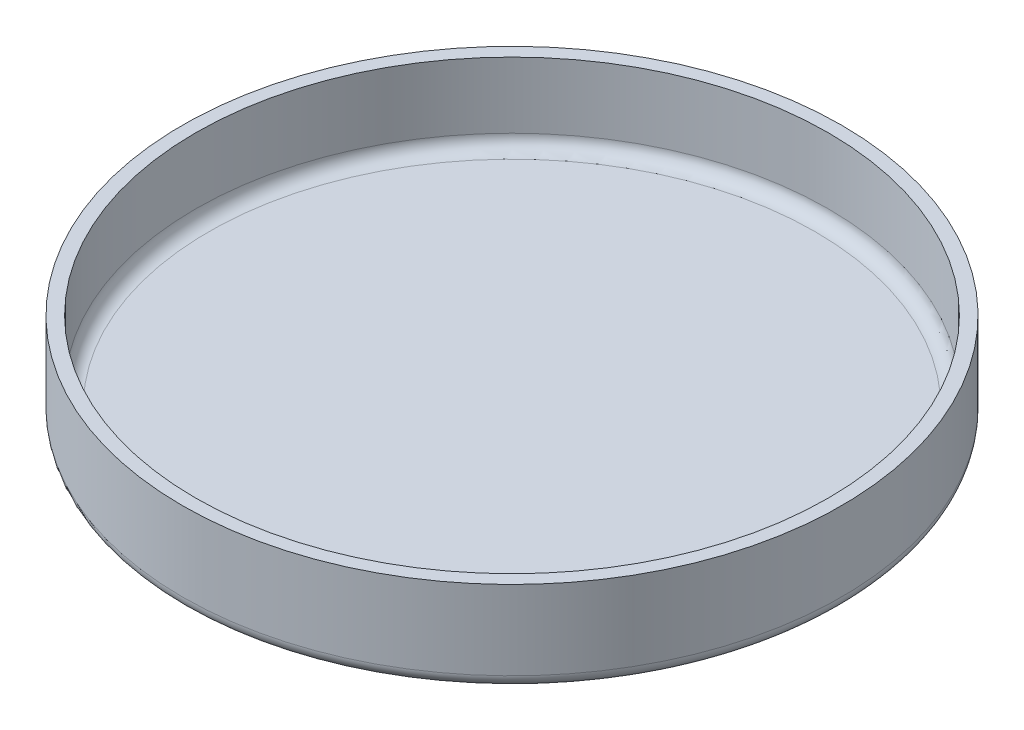
ISO-10303-21;
HEADER;
FILE_DESCRIPTION(('STEP AP214'),'2;1');
FILE_NAME('part.step','',(''),(''),'','','');
FILE_SCHEMA(('AUTOMOTIVE_DESIGN { 1 0 10303 214 1 1 1 1 }'));
ENDSEC;
DATA;
#1=APPLICATION_CONTEXT('core data for automotive mechanical design processes');
#2=APPLICATION_PROTOCOL_DEFINITION('international standard','automotive_design',2000,#1);
#3=PRODUCT_CONTEXT('',#1,'mechanical');
#4=PRODUCT('Part','Part','',(#3));
#5=PRODUCT_RELATED_PRODUCT_CATEGORY('part','',(#4));
#6=PRODUCT_DEFINITION_FORMATION('','',#4);
#7=PRODUCT_DEFINITION_CONTEXT('part definition',#1,'design');
#8=PRODUCT_DEFINITION('design','',#6,#7);
#9=PRODUCT_DEFINITION_SHAPE('','',#8);
#10=(LENGTH_UNIT() NAMED_UNIT(*) SI_UNIT(.MILLI.,.METRE.));
#11=(NAMED_UNIT(*) PLANE_ANGLE_UNIT() SI_UNIT($,.RADIAN.));
#12=(NAMED_UNIT(*) SI_UNIT($,.STERADIAN.) SOLID_ANGLE_UNIT());
#13=UNCERTAINTY_MEASURE_WITH_UNIT(LENGTH_MEASURE(1.E-05),#10,'distance_accuracy_value','');
#14=(GEOMETRIC_REPRESENTATION_CONTEXT(3) GLOBAL_UNCERTAINTY_ASSIGNED_CONTEXT((#13)) GLOBAL_UNIT_ASSIGNED_CONTEXT((#10,
#11,#12)) REPRESENTATION_CONTEXT('',''));
#15=CARTESIAN_POINT('',(0.,0.,0.));
#16=DIRECTION('',(0.,0.,1.));
#17=DIRECTION('',(1.,0.,0.));
#18=AXIS2_PLACEMENT_3D('',#15,#16,#17);
#19=CARTESIAN_POINT('',(0.,7.,0.));
#20=DIRECTION('',(0.,-1.,0.));
#21=DIRECTION('',(0.,0.,-1.));
#22=AXIS2_PLACEMENT_3D('',#19,#20,#21);
#23=CYLINDRICAL_SURFACE('',#22,25.);
#24=CARTESIAN_POINT('',(0.,1.,0.));
#25=DIRECTION('',(0.,1.,0.));
#26=DIRECTION('',(0.,0.,1.));
#27=AXIS2_PLACEMENT_3D('',#24,#25,#26);
#28=CIRCLE('',#27,25.);
#29=CARTESIAN_POINT('',(0.,1.,25.));
#30=VERTEX_POINT('',#29);
#31=EDGE_CURVE('E47',#30,#30,#28,.T.);
#32=ORIENTED_EDGE('',*,*,#31,.T.);
#33=EDGE_LOOP('',(#32));
#34=FACE_BOUND('',#33,.T.);
#35=CARTESIAN_POINT('',(0.,7.,0.));
#36=DIRECTION('',(0.,1.,0.));
#37=DIRECTION('',(0.,0.,1.));
#38=AXIS2_PLACEMENT_3D('',#35,#36,#37);
#39=CIRCLE('',#38,25.);
#40=CARTESIAN_POINT('',(0.,7.,25.));
#41=VERTEX_POINT('',#40);
#42=EDGE_CURVE('E52',#41,#41,#39,.T.);
#43=ORIENTED_EDGE('',*,*,#42,.F.);
#44=EDGE_LOOP('',(#43));
#45=FACE_BOUND('',#44,.T.);
#46=ADVANCED_FACE('F32',(#34,#45),#23,.T.);
#47=CARTESIAN_POINT('',(0.,7.,0.));
#48=DIRECTION('',(0.,1.,0.));
#49=DIRECTION('',(0.,0.,1.));
#50=AXIS2_PLACEMENT_3D('',#47,#48,#49);
#51=PLANE('',#50);
#52=CARTESIAN_POINT('',(0.,7.,0.));
#53=DIRECTION('',(0.,1.,0.));
#54=DIRECTION('',(0.,0.,1.));
#55=AXIS2_PLACEMENT_3D('',#52,#53,#54);
#56=CIRCLE('',#55,24.);
#57=CARTESIAN_POINT('',(0.,7.,24.));
#58=VERTEX_POINT('',#57);
#59=EDGE_CURVE('E55',#58,#58,#56,.T.);
#60=ORIENTED_EDGE('',*,*,#59,.F.);
#61=EDGE_LOOP('',(#60));
#62=FACE_BOUND('',#61,.T.);
#63=ORIENTED_EDGE('',*,*,#42,.T.);
#64=EDGE_LOOP('',(#63));
#65=FACE_BOUND('',#64,.T.);
#66=ADVANCED_FACE('F61',(#62,#65),#51,.T.);
#67=CARTESIAN_POINT('',(0.,0.,0.));
#68=DIRECTION('',(0.,1.,0.));
#69=DIRECTION('',(0.,0.,1.));
#70=AXIS2_PLACEMENT_3D('',#67,#68,#69);
#71=PLANE('',#70);
#72=CARTESIAN_POINT('',(0.,0.,0.));
#73=DIRECTION('',(0.,1.,0.));
#74=DIRECTION('',(0.,0.,1.));
#75=AXIS2_PLACEMENT_3D('',#72,#73,#74);
#76=CIRCLE('',#75,24.);
#77=CARTESIAN_POINT('',(0.,0.,24.));
#78=VERTEX_POINT('',#77);
#79=EDGE_CURVE('E43',#78,#78,#76,.F.);
#80=ORIENTED_EDGE('',*,*,#79,.T.);
#81=EDGE_LOOP('',(#80));
#82=FACE_BOUND('',#81,.T.);
#83=ADVANCED_FACE('F64',(#82),#71,.F.);
#84=CARTESIAN_POINT('',(0.,1.,0.));
#85=DIRECTION('',(0.,1.,0.));
#86=DIRECTION('',(0.,0.,1.));
#87=AXIS2_PLACEMENT_3D('',#84,#85,#86);
#88=CYLINDRICAL_SURFACE('',#87,24.);
#89=CARTESIAN_POINT('',(0.,2.,0.));
#90=DIRECTION('',(0.,1.,0.));
#91=DIRECTION('',(0.,0.,1.));
#92=AXIS2_PLACEMENT_3D('',#89,#90,#91);
#93=CIRCLE('',#92,24.);
#94=CARTESIAN_POINT('',(0.,2.,24.));
#95=VERTEX_POINT('',#94);
#96=EDGE_CURVE('E10',#95,#95,#93,.F.);
#97=ORIENTED_EDGE('',*,*,#96,.T.);
#98=EDGE_LOOP('',(#97));
#99=FACE_BOUND('',#98,.T.);
#100=ORIENTED_EDGE('',*,*,#59,.T.);
#101=EDGE_LOOP('',(#100));
#102=FACE_BOUND('',#101,.T.);
#103=ADVANCED_FACE('F59',(#99,#102),#88,.F.);
#104=CARTESIAN_POINT('',(0.,1.,0.));
#105=DIRECTION('',(0.,1.,0.));
#106=DIRECTION('',(0.,0.,1.));
#107=AXIS2_PLACEMENT_3D('',#104,#105,#106);
#108=PLANE('',#107);
#109=CARTESIAN_POINT('',(0.,1.,0.));
#110=DIRECTION('',(0.,1.,0.));
#111=DIRECTION('',(0.,0.,1.));
#112=AXIS2_PLACEMENT_3D('',#109,#110,#111);
#113=CIRCLE('',#112,23.);
#114=CARTESIAN_POINT('',(0.,1.,23.));
#115=VERTEX_POINT('',#114);
#116=EDGE_CURVE('E39',#115,#115,#113,.T.);
#117=ORIENTED_EDGE('',*,*,#116,.T.);
#118=EDGE_LOOP('',(#117));
#119=FACE_BOUND('',#118,.T.);
#120=ADVANCED_FACE('F76',(#119),#108,.T.);
#121=CARTESIAN_POINT('',(0.,1.,0.));
#122=DIRECTION('',(0.,1.,0.));
#123=DIRECTION('',(0.,0.,1.));
#124=AXIS2_PLACEMENT_3D('',#121,#122,#123);
#125=TOROIDAL_SURFACE('',#124,24.,1.);
#126=ORIENTED_EDGE('',*,*,#79,.F.);
#127=EDGE_LOOP('',(#126));
#128=FACE_BOUND('',#127,.T.);
#129=ORIENTED_EDGE('',*,*,#31,.F.);
#130=EDGE_LOOP('',(#129));
#131=FACE_BOUND('',#130,.T.);
#132=ADVANCED_FACE('F74',(#128,#131),#125,.T.);
#133=CARTESIAN_POINT('',(0.,2.,0.));
#134=DIRECTION('',(0.,1.,0.));
#135=DIRECTION('',(0.,0.,1.));
#136=AXIS2_PLACEMENT_3D('',#133,#134,#135);
#137=TOROIDAL_SURFACE('',#136,23.,1.);
#138=ORIENTED_EDGE('',*,*,#96,.F.);
#139=EDGE_LOOP('',(#138));
#140=FACE_BOUND('',#139,.T.);
#141=ORIENTED_EDGE('',*,*,#116,.F.);
#142=EDGE_LOOP('',(#141));
#143=FACE_BOUND('',#142,.T.);
#144=ADVANCED_FACE('F34',(#140,#143),#137,.F.);
#145=CLOSED_SHELL('',(#46,#66,#83,#103,#120,#132,#144));
#146=MANIFOLD_SOLID_BREP('B2',#145);
#147=ADVANCED_BREP_SHAPE_REPRESENTATION('',(#18,#146),#14);
#148=SHAPE_DEFINITION_REPRESENTATION(#9,#147);
ENDSEC;
END-ISO-10303-21;
